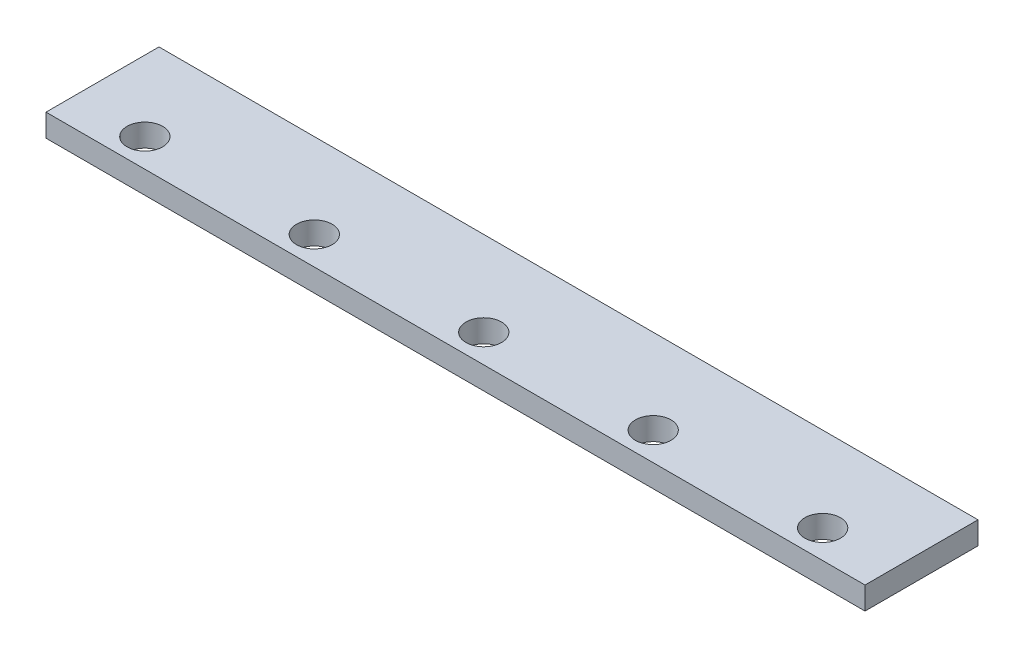
ISO-10303-21;
HEADER;
FILE_DESCRIPTION(('STEP AP214'),'2;1');
FILE_NAME('part.step','',(''),(''),'','','');
FILE_SCHEMA(('AUTOMOTIVE_DESIGN { 1 0 10303 214 1 1 1 1 }'));
ENDSEC;
DATA;
#1=APPLICATION_CONTEXT('core data for automotive mechanical design processes');
#2=APPLICATION_PROTOCOL_DEFINITION('international standard','automotive_design',2000,#1);
#3=PRODUCT_CONTEXT('',#1,'mechanical');
#4=PRODUCT('Part','Part','',(#3));
#5=PRODUCT_RELATED_PRODUCT_CATEGORY('part','',(#4));
#6=PRODUCT_DEFINITION_FORMATION('','',#4);
#7=PRODUCT_DEFINITION_CONTEXT('part definition',#1,'design');
#8=PRODUCT_DEFINITION('design','',#6,#7);
#9=PRODUCT_DEFINITION_SHAPE('','',#8);
#10=(LENGTH_UNIT() NAMED_UNIT(*) SI_UNIT(.MILLI.,.METRE.));
#11=(NAMED_UNIT(*) PLANE_ANGLE_UNIT() SI_UNIT($,.RADIAN.));
#12=(NAMED_UNIT(*) SI_UNIT($,.STERADIAN.) SOLID_ANGLE_UNIT());
#13=UNCERTAINTY_MEASURE_WITH_UNIT(LENGTH_MEASURE(1.E-05),#10,'distance_accuracy_value','');
#14=(GEOMETRIC_REPRESENTATION_CONTEXT(3) GLOBAL_UNCERTAINTY_ASSIGNED_CONTEXT((#13)) GLOBAL_UNIT_ASSIGNED_CONTEXT((#10,
#11,#12)) REPRESENTATION_CONTEXT('',''));
#15=CARTESIAN_POINT('',(0.,0.,0.));
#16=DIRECTION('',(0.,0.,1.));
#17=DIRECTION('',(1.,0.,0.));
#18=AXIS2_PLACEMENT_3D('',#15,#16,#17);
#19=CARTESIAN_POINT('',(290.,16.,-40.));
#20=DIRECTION('',(-1.,0.,0.));
#21=DIRECTION('',(0.,0.,1.));
#22=AXIS2_PLACEMENT_3D('',#19,#20,#21);
#23=PLANE('',#22);
#24=DIRECTION('',(0.,0.,-1.));
#25=VECTOR('',#24,1.);
#26=CARTESIAN_POINT('',(290.,0.,-40.));
#27=LINE('',#26,#25);
#28=CARTESIAN_POINT('',(290.,0.,40.));
#29=VERTEX_POINT('',#28);
#30=CARTESIAN_POINT('',(290.,0.,-40.));
#31=VERTEX_POINT('',#30);
#32=EDGE_CURVE('E102',#29,#31,#27,.T.);
#33=ORIENTED_EDGE('',*,*,#32,.T.);
#34=DIRECTION('',(0.,-1.,0.));
#35=VECTOR('',#34,1.);
#36=CARTESIAN_POINT('',(290.,16.,-40.));
#37=LINE('',#36,#35);
#38=CARTESIAN_POINT('',(290.,16.,-40.));
#39=VERTEX_POINT('',#38);
#40=EDGE_CURVE('E93',#39,#31,#37,.T.);
#41=ORIENTED_EDGE('',*,*,#40,.F.);
#42=DIRECTION('',(0.,0.,-1.));
#43=VECTOR('',#42,1.);
#44=CARTESIAN_POINT('',(290.,16.,-40.));
#45=LINE('',#44,#43);
#46=CARTESIAN_POINT('',(290.,16.,40.));
#47=VERTEX_POINT('',#46);
#48=EDGE_CURVE('E87',#47,#39,#45,.T.);
#49=ORIENTED_EDGE('',*,*,#48,.F.);
#50=DIRECTION('',(0.,-1.,0.));
#51=VECTOR('',#50,1.);
#52=CARTESIAN_POINT('',(290.,16.,40.));
#53=LINE('',#52,#51);
#54=EDGE_CURVE('E98',#47,#29,#53,.T.);
#55=ORIENTED_EDGE('',*,*,#54,.T.);
#56=EDGE_LOOP('',(#33,#41,#49,#55));
#57=FACE_BOUND('',#56,.T.);
#58=ADVANCED_FACE('F33',(#57),#23,.F.);
#59=CARTESIAN_POINT('',(-290.,16.,-40.));
#60=DIRECTION('',(0.,0.,1.));
#61=DIRECTION('',(1.,0.,0.));
#62=AXIS2_PLACEMENT_3D('',#59,#60,#61);
#63=PLANE('',#62);
#64=DIRECTION('',(-1.,0.,0.));
#65=VECTOR('',#64,1.);
#66=CARTESIAN_POINT('',(-290.,0.,-40.));
#67=LINE('',#66,#65);
#68=CARTESIAN_POINT('',(-290.,0.,-40.));
#69=VERTEX_POINT('',#68);
#70=EDGE_CURVE('E92',#31,#69,#67,.T.);
#71=ORIENTED_EDGE('',*,*,#70,.T.);
#72=DIRECTION('',(0.,-1.,0.));
#73=VECTOR('',#72,1.);
#74=CARTESIAN_POINT('',(-290.,16.,-40.));
#75=LINE('',#74,#73);
#76=CARTESIAN_POINT('',(-290.,16.,-40.));
#77=VERTEX_POINT('',#76);
#78=EDGE_CURVE('E90',#77,#69,#75,.T.);
#79=ORIENTED_EDGE('',*,*,#78,.F.);
#80=DIRECTION('',(-1.,0.,0.));
#81=VECTOR('',#80,1.);
#82=CARTESIAN_POINT('',(-290.,16.,-40.));
#83=LINE('',#82,#81);
#84=EDGE_CURVE('E81',#39,#77,#83,.T.);
#85=ORIENTED_EDGE('',*,*,#84,.F.);
#86=ORIENTED_EDGE('',*,*,#40,.T.);
#87=EDGE_LOOP('',(#71,#79,#85,#86));
#88=FACE_BOUND('',#87,.T.);
#89=ADVANCED_FACE('F91',(#88),#63,.F.);
#90=CARTESIAN_POINT('',(-290.,16.,-40.));
#91=DIRECTION('',(1.,0.,0.));
#92=DIRECTION('',(0.,0.,-1.));
#93=AXIS2_PLACEMENT_3D('',#90,#91,#92);
#94=PLANE('',#93);
#95=DIRECTION('',(0.,0.,1.));
#96=VECTOR('',#95,1.);
#97=CARTESIAN_POINT('',(-290.,0.,-40.));
#98=LINE('',#97,#96);
#99=CARTESIAN_POINT('',(-290.,0.,40.));
#100=VERTEX_POINT('',#99);
#101=EDGE_CURVE('E67',#69,#100,#98,.T.);
#102=ORIENTED_EDGE('',*,*,#101,.T.);
#103=DIRECTION('',(0.,-1.,0.));
#104=VECTOR('',#103,1.);
#105=CARTESIAN_POINT('',(-290.,16.,40.));
#106=LINE('',#105,#104);
#107=CARTESIAN_POINT('',(-290.,16.,40.));
#108=VERTEX_POINT('',#107);
#109=EDGE_CURVE('E94',#108,#100,#106,.T.);
#110=ORIENTED_EDGE('',*,*,#109,.F.);
#111=DIRECTION('',(0.,0.,1.));
#112=VECTOR('',#111,1.);
#113=CARTESIAN_POINT('',(-290.,16.,-40.));
#114=LINE('',#113,#112);
#115=EDGE_CURVE('E85',#77,#108,#114,.T.);
#116=ORIENTED_EDGE('',*,*,#115,.F.);
#117=ORIENTED_EDGE('',*,*,#78,.T.);
#118=EDGE_LOOP('',(#102,#110,#116,#117));
#119=FACE_BOUND('',#118,.T.);
#120=ADVANCED_FACE('F96',(#119),#94,.F.);
#121=CARTESIAN_POINT('',(-290.,16.,40.));
#122=DIRECTION('',(0.,0.,-1.));
#123=DIRECTION('',(-1.,0.,0.));
#124=AXIS2_PLACEMENT_3D('',#121,#122,#123);
#125=PLANE('',#124);
#126=DIRECTION('',(1.,0.,0.));
#127=VECTOR('',#126,1.);
#128=CARTESIAN_POINT('',(-290.,0.,40.));
#129=LINE('',#128,#127);
#130=EDGE_CURVE('E73',#100,#29,#129,.T.);
#131=ORIENTED_EDGE('',*,*,#130,.T.);
#132=ORIENTED_EDGE('',*,*,#54,.F.);
#133=DIRECTION('',(1.,0.,0.));
#134=VECTOR('',#133,1.);
#135=CARTESIAN_POINT('',(-290.,16.,40.));
#136=LINE('',#135,#134);
#137=EDGE_CURVE('E50',#108,#47,#136,.T.);
#138=ORIENTED_EDGE('',*,*,#137,.F.);
#139=ORIENTED_EDGE('',*,*,#109,.T.);
#140=EDGE_LOOP('',(#131,#132,#138,#139));
#141=FACE_BOUND('',#140,.T.);
#142=ADVANCED_FACE('F134',(#141),#125,.F.);
#143=CARTESIAN_POINT('',(0.,16.,0.));
#144=DIRECTION('',(0.,1.,0.));
#145=DIRECTION('',(0.,0.,1.));
#146=AXIS2_PLACEMENT_3D('',#143,#144,#145);
#147=PLANE('',#146);
#148=CARTESIAN_POINT('',(-120.,16.,20.));
#149=DIRECTION('',(0.,1.,0.));
#150=DIRECTION('',(0.,0.,1.));
#151=AXIS2_PLACEMENT_3D('',#148,#149,#150);
#152=CIRCLE('',#151,12.6);
#153=CARTESIAN_POINT('',(-120.,16.,32.6));
#154=VERTEX_POINT('',#153);
#155=EDGE_CURVE('E242',#154,#154,#152,.T.);
#156=ORIENTED_EDGE('',*,*,#155,.F.);
#157=EDGE_LOOP('',(#156));
#158=FACE_BOUND('',#157,.T.);
#159=CARTESIAN_POINT('',(-240.,16.,20.));
#160=DIRECTION('',(0.,1.,0.));
#161=DIRECTION('',(0.,0.,1.));
#162=AXIS2_PLACEMENT_3D('',#159,#160,#161);
#163=CIRCLE('',#162,12.6);
#164=CARTESIAN_POINT('',(-240.,16.,32.6));
#165=VERTEX_POINT('',#164);
#166=EDGE_CURVE('E241',#165,#165,#163,.T.);
#167=ORIENTED_EDGE('',*,*,#166,.F.);
#168=EDGE_LOOP('',(#167));
#169=FACE_BOUND('',#168,.T.);
#170=ORIENTED_EDGE('',*,*,#48,.T.);
#171=ORIENTED_EDGE('',*,*,#84,.T.);
#172=ORIENTED_EDGE('',*,*,#115,.T.);
#173=ORIENTED_EDGE('',*,*,#137,.T.);
#174=EDGE_LOOP('',(#170,#171,#172,#173));
#175=FACE_BOUND('',#174,.T.);
#176=CARTESIAN_POINT('',(-1.11022302462516E-13,16.,20.));
#177=DIRECTION('',(0.,1.,0.));
#178=DIRECTION('',(0.,0.,1.));
#179=AXIS2_PLACEMENT_3D('',#176,#177,#178);
#180=CIRCLE('',#179,12.6);
#181=CARTESIAN_POINT('',(-1.11022302462516E-13,16.,32.6));
#182=VERTEX_POINT('',#181);
#183=EDGE_CURVE('E115',#182,#182,#180,.T.);
#184=ORIENTED_EDGE('',*,*,#183,.F.);
#185=EDGE_LOOP('',(#184));
#186=FACE_BOUND('',#185,.T.);
#187=CARTESIAN_POINT('',(120.,16.,20.));
#188=DIRECTION('',(0.,1.,0.));
#189=DIRECTION('',(0.,0.,1.));
#190=AXIS2_PLACEMENT_3D('',#187,#188,#189);
#191=CIRCLE('',#190,12.6);
#192=CARTESIAN_POINT('',(120.,16.,32.6));
#193=VERTEX_POINT('',#192);
#194=EDGE_CURVE('E121',#193,#193,#191,.T.);
#195=ORIENTED_EDGE('',*,*,#194,.F.);
#196=EDGE_LOOP('',(#195));
#197=FACE_BOUND('',#196,.T.);
#198=CARTESIAN_POINT('',(240.,16.,20.));
#199=DIRECTION('',(0.,1.,0.));
#200=DIRECTION('',(0.,0.,1.));
#201=AXIS2_PLACEMENT_3D('',#198,#199,#200);
#202=CIRCLE('',#201,12.6);
#203=CARTESIAN_POINT('',(240.,16.,32.6));
#204=VERTEX_POINT('',#203);
#205=EDGE_CURVE('E11',#204,#204,#202,.T.);
#206=ORIENTED_EDGE('',*,*,#205,.F.);
#207=EDGE_LOOP('',(#206));
#208=FACE_BOUND('',#207,.T.);
#209=ADVANCED_FACE('F82',(#158,#169,#175,#186,#197,#208),#147,.T.);
#210=CARTESIAN_POINT('',(0.,0.,0.));
#211=DIRECTION('',(0.,1.,0.));
#212=DIRECTION('',(0.,0.,1.));
#213=AXIS2_PLACEMENT_3D('',#210,#211,#212);
#214=PLANE('',#213);
#215=CARTESIAN_POINT('',(-120.,0.,20.));
#216=DIRECTION('',(0.,1.,0.));
#217=DIRECTION('',(0.,0.,1.));
#218=AXIS2_PLACEMENT_3D('',#215,#216,#217);
#219=CIRCLE('',#218,12.6);
#220=CARTESIAN_POINT('',(-120.,0.,32.6));
#221=VERTEX_POINT('',#220);
#222=EDGE_CURVE('E246',#221,#221,#219,.T.);
#223=ORIENTED_EDGE('',*,*,#222,.T.);
#224=EDGE_LOOP('',(#223));
#225=FACE_BOUND('',#224,.T.);
#226=CARTESIAN_POINT('',(-240.,0.,20.));
#227=DIRECTION('',(0.,1.,0.));
#228=DIRECTION('',(0.,0.,1.));
#229=AXIS2_PLACEMENT_3D('',#226,#227,#228);
#230=CIRCLE('',#229,12.6);
#231=CARTESIAN_POINT('',(-240.,0.,32.6));
#232=VERTEX_POINT('',#231);
#233=EDGE_CURVE('E105',#232,#232,#230,.T.);
#234=ORIENTED_EDGE('',*,*,#233,.T.);
#235=EDGE_LOOP('',(#234));
#236=FACE_BOUND('',#235,.T.);
#237=ORIENTED_EDGE('',*,*,#32,.F.);
#238=ORIENTED_EDGE('',*,*,#130,.F.);
#239=ORIENTED_EDGE('',*,*,#101,.F.);
#240=ORIENTED_EDGE('',*,*,#70,.F.);
#241=EDGE_LOOP('',(#237,#238,#239,#240));
#242=FACE_BOUND('',#241,.T.);
#243=CARTESIAN_POINT('',(-1.11022302462516E-13,0.,20.));
#244=DIRECTION('',(0.,1.,0.));
#245=DIRECTION('',(0.,0.,1.));
#246=AXIS2_PLACEMENT_3D('',#243,#244,#245);
#247=CIRCLE('',#246,12.6);
#248=CARTESIAN_POINT('',(-1.11022302462516E-13,0.,32.6));
#249=VERTEX_POINT('',#248);
#250=EDGE_CURVE('E112',#249,#249,#247,.T.);
#251=ORIENTED_EDGE('',*,*,#250,.T.);
#252=EDGE_LOOP('',(#251));
#253=FACE_BOUND('',#252,.T.);
#254=CARTESIAN_POINT('',(120.,0.,20.));
#255=DIRECTION('',(0.,1.,0.));
#256=DIRECTION('',(0.,0.,1.));
#257=AXIS2_PLACEMENT_3D('',#254,#255,#256);
#258=CIRCLE('',#257,12.6);
#259=CARTESIAN_POINT('',(120.,0.,32.6));
#260=VERTEX_POINT('',#259);
#261=EDGE_CURVE('E118',#260,#260,#258,.T.);
#262=ORIENTED_EDGE('',*,*,#261,.T.);
#263=EDGE_LOOP('',(#262));
#264=FACE_BOUND('',#263,.T.);
#265=CARTESIAN_POINT('',(240.,0.,20.));
#266=DIRECTION('',(0.,1.,0.));
#267=DIRECTION('',(0.,0.,1.));
#268=AXIS2_PLACEMENT_3D('',#265,#266,#267);
#269=CIRCLE('',#268,12.6);
#270=CARTESIAN_POINT('',(240.,0.,32.6));
#271=VERTEX_POINT('',#270);
#272=EDGE_CURVE('E42',#271,#271,#269,.T.);
#273=ORIENTED_EDGE('',*,*,#272,.T.);
#274=EDGE_LOOP('',(#273));
#275=FACE_BOUND('',#274,.T.);
#276=ADVANCED_FACE('F126',(#225,#236,#242,#253,#264,#275),#214,.F.);
#277=CARTESIAN_POINT('',(-240.,0.,20.));
#278=DIRECTION('',(0.,1.,0.));
#279=DIRECTION('',(0.,0.,1.));
#280=AXIS2_PLACEMENT_3D('',#277,#278,#279);
#281=CYLINDRICAL_SURFACE('',#280,12.6);
#282=ORIENTED_EDGE('',*,*,#233,.F.);
#283=EDGE_LOOP('',(#282));
#284=FACE_BOUND('',#283,.T.);
#285=ORIENTED_EDGE('',*,*,#166,.T.);
#286=EDGE_LOOP('',(#285));
#287=FACE_BOUND('',#286,.T.);
#288=ADVANCED_FACE('F141',(#284,#287),#281,.F.);
#289=CARTESIAN_POINT('',(-120.,0.,20.));
#290=DIRECTION('',(0.,1.,0.));
#291=DIRECTION('',(0.,0.,1.));
#292=AXIS2_PLACEMENT_3D('',#289,#290,#291);
#293=CYLINDRICAL_SURFACE('',#292,12.6);
#294=ORIENTED_EDGE('',*,*,#222,.F.);
#295=EDGE_LOOP('',(#294));
#296=FACE_BOUND('',#295,.T.);
#297=ORIENTED_EDGE('',*,*,#155,.T.);
#298=EDGE_LOOP('',(#297));
#299=FACE_BOUND('',#298,.T.);
#300=ADVANCED_FACE('F159',(#296,#299),#293,.F.);
#301=CARTESIAN_POINT('',(-1.11022302462516E-13,0.,20.));
#302=DIRECTION('',(0.,1.,0.));
#303=DIRECTION('',(0.,0.,1.));
#304=AXIS2_PLACEMENT_3D('',#301,#302,#303);
#305=CYLINDRICAL_SURFACE('',#304,12.6);
#306=ORIENTED_EDGE('',*,*,#250,.F.);
#307=EDGE_LOOP('',(#306));
#308=FACE_BOUND('',#307,.T.);
#309=ORIENTED_EDGE('',*,*,#183,.T.);
#310=EDGE_LOOP('',(#309));
#311=FACE_BOUND('',#310,.T.);
#312=ADVANCED_FACE('F157',(#308,#311),#305,.F.);
#313=CARTESIAN_POINT('',(120.,0.,20.));
#314=DIRECTION('',(0.,1.,0.));
#315=DIRECTION('',(0.,0.,1.));
#316=AXIS2_PLACEMENT_3D('',#313,#314,#315);
#317=CYLINDRICAL_SURFACE('',#316,12.6);
#318=ORIENTED_EDGE('',*,*,#261,.F.);
#319=EDGE_LOOP('',(#318));
#320=FACE_BOUND('',#319,.T.);
#321=ORIENTED_EDGE('',*,*,#194,.T.);
#322=EDGE_LOOP('',(#321));
#323=FACE_BOUND('',#322,.T.);
#324=ADVANCED_FACE('F130',(#320,#323),#317,.F.);
#325=CARTESIAN_POINT('',(240.,0.,20.));
#326=DIRECTION('',(0.,1.,0.));
#327=DIRECTION('',(0.,0.,1.));
#328=AXIS2_PLACEMENT_3D('',#325,#326,#327);
#329=CYLINDRICAL_SURFACE('',#328,12.6);
#330=ORIENTED_EDGE('',*,*,#272,.F.);
#331=EDGE_LOOP('',(#330));
#332=FACE_BOUND('',#331,.T.);
#333=ORIENTED_EDGE('',*,*,#205,.T.);
#334=EDGE_LOOP('',(#333));
#335=FACE_BOUND('',#334,.T.);
#336=ADVANCED_FACE('F35',(#332,#335),#329,.F.);
#337=CLOSED_SHELL('',(#58,#89,#120,#142,#209,#276,#288,#300,#312,#324,#336));
#338=MANIFOLD_SOLID_BREP('B2',#337);
#339=ADVANCED_BREP_SHAPE_REPRESENTATION('',(#18,#338),#14);
#340=SHAPE_DEFINITION_REPRESENTATION(#9,#339);
ENDSEC;
END-ISO-10303-21;
